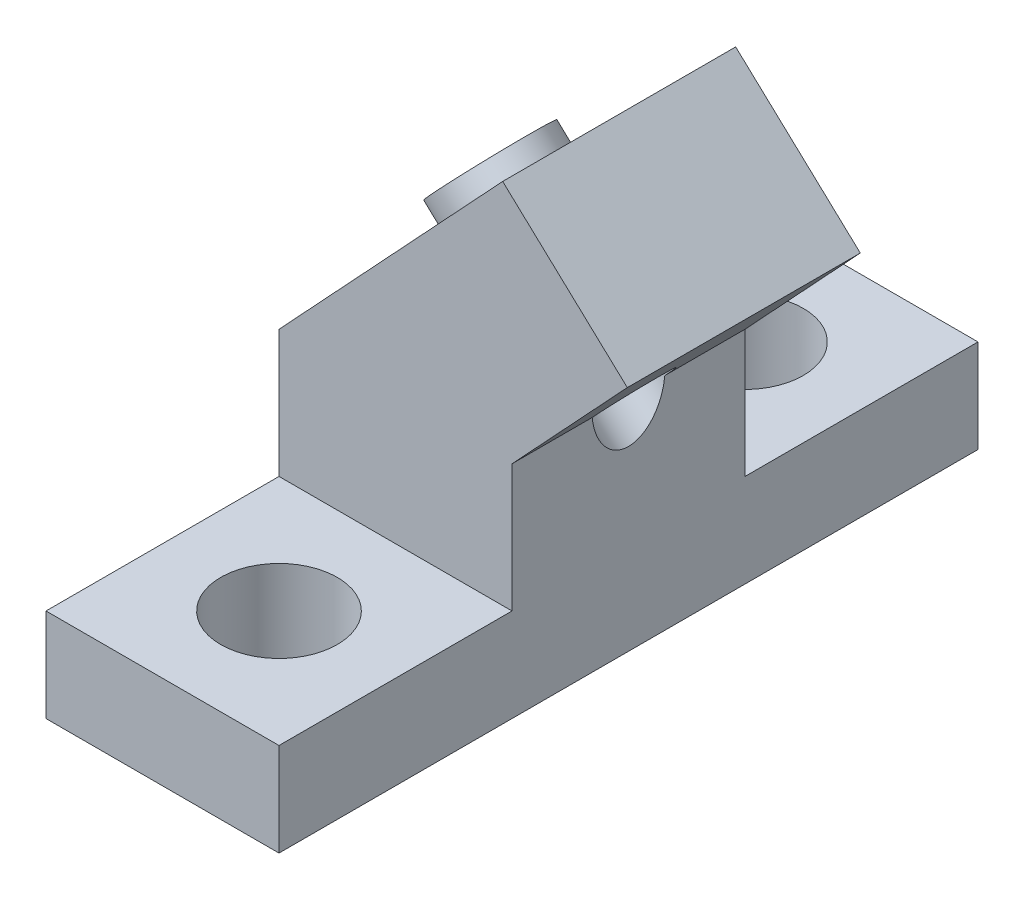
ISO-10303-21;
HEADER;
FILE_DESCRIPTION(('STEP AP214'),'2;1');
FILE_NAME('part.step','',(''),(''),'','','');
FILE_SCHEMA(('AUTOMOTIVE_DESIGN { 1 0 10303 214 1 1 1 1 }'));
ENDSEC;
DATA;
#1=APPLICATION_CONTEXT('core data for automotive mechanical design processes');
#2=APPLICATION_PROTOCOL_DEFINITION('international standard','automotive_design',2000,#1);
#3=PRODUCT_CONTEXT('',#1,'mechanical');
#4=PRODUCT('Part','Part','',(#3));
#5=PRODUCT_RELATED_PRODUCT_CATEGORY('part','',(#4));
#6=PRODUCT_DEFINITION_FORMATION('','',#4);
#7=PRODUCT_DEFINITION_CONTEXT('part definition',#1,'design');
#8=PRODUCT_DEFINITION('design','',#6,#7);
#9=PRODUCT_DEFINITION_SHAPE('','',#8);
#10=(LENGTH_UNIT() NAMED_UNIT(*) SI_UNIT(.MILLI.,.METRE.));
#11=(NAMED_UNIT(*) PLANE_ANGLE_UNIT() SI_UNIT($,.RADIAN.));
#12=(NAMED_UNIT(*) SI_UNIT($,.STERADIAN.) SOLID_ANGLE_UNIT());
#13=UNCERTAINTY_MEASURE_WITH_UNIT(LENGTH_MEASURE(1.E-05),#10,'distance_accuracy_value','');
#14=(GEOMETRIC_REPRESENTATION_CONTEXT(3) GLOBAL_UNCERTAINTY_ASSIGNED_CONTEXT((#13)) GLOBAL_UNIT_ASSIGNED_CONTEXT((#10,
#11,#12)) REPRESENTATION_CONTEXT('',''));
#15=CARTESIAN_POINT('',(0.,0.,0.));
#16=DIRECTION('',(0.,0.,1.));
#17=DIRECTION('',(1.,0.,0.));
#18=AXIS2_PLACEMENT_3D('',#15,#16,#17);
#19=CARTESIAN_POINT('',(0.,12.0277024264101,12.7));
#20=DIRECTION('',(0.731353701619172,-0.681998360062497,0.));
#21=DIRECTION('',(0.681998360062497,0.731353701619172,0.));
#22=AXIS2_PLACEMENT_3D('',#19,#20,#21);
#23=PLANE('',#22);
#24=DIRECTION('',(-0.681998360062497,-0.731353701619172,0.));
#25=VECTOR('',#24,1.);
#26=CARTESIAN_POINT('',(0.,12.0277024264101,0.));
#27=LINE('',#26,#25);
#28=CARTESIAN_POINT('',(12.192,25.1020217390311,0.));
#29=VERTEX_POINT('',#28);
#30=CARTESIAN_POINT('',(0.,12.0277024264101,0.));
#31=VERTEX_POINT('',#30);
#32=EDGE_CURVE('E191',#29,#31,#27,.T.);
#33=ORIENTED_EDGE('',*,*,#32,.T.);
#34=DIRECTION('',(0.,0.,-1.));
#35=VECTOR('',#34,1.);
#36=CARTESIAN_POINT('',(0.,12.0277024264101,12.7));
#37=LINE('',#36,#35);
#38=CARTESIAN_POINT('',(0.,12.0277024264101,12.7));
#39=VERTEX_POINT('',#38);
#40=EDGE_CURVE('E198',#39,#31,#37,.T.);
#41=ORIENTED_EDGE('',*,*,#40,.F.);
#42=DIRECTION('',(-0.681998360062497,-0.731353701619172,0.));
#43=VECTOR('',#42,1.);
#44=CARTESIAN_POINT('',(0.,12.0277024264101,12.7));
#45=LINE('',#44,#43);
#46=CARTESIAN_POINT('',(12.192,25.1020217390311,12.7));
#47=VERTEX_POINT('',#46);
#48=EDGE_CURVE('E196',#47,#39,#45,.T.);
#49=ORIENTED_EDGE('',*,*,#48,.F.);
#50=DIRECTION('',(0.,0.,-1.));
#51=VECTOR('',#50,1.);
#52=CARTESIAN_POINT('',(12.192,25.1020217390311,12.7));
#53=LINE('',#52,#51);
#54=EDGE_CURVE('E207',#47,#29,#53,.T.);
#55=ORIENTED_EDGE('',*,*,#54,.T.);
#56=EDGE_LOOP('',(#33,#41,#49,#55));
#57=FACE_BOUND('',#56,.T.);
#58=CARTESIAN_POINT('',(6.096,18.5648620827206,6.35));
#59=DIRECTION('',(0.731353701619172,-0.681998360062497,0.));
#60=DIRECTION('',(0.681998360062497,0.731353701619172,0.));
#61=AXIS2_PLACEMENT_3D('',#58,#59,#60);
#62=CIRCLE('',#61,3.);
#63=CARTESIAN_POINT('',(8.14199508018749,20.7589231875781,6.35));
#64=VERTEX_POINT('',#63);
#65=EDGE_CURVE('E11',#64,#64,#62,.F.);
#66=ORIENTED_EDGE('',*,*,#65,.F.);
#67=EDGE_LOOP('',(#66));
#68=FACE_BOUND('',#67,.T.);
#69=ADVANCED_FACE('F39',(#57,#68),#23,.F.);
#70=CARTESIAN_POINT('',(0.,0.,0.));
#71=DIRECTION('',(0.,0.,-1.));
#72=DIRECTION('',(-1.,0.,0.));
#73=AXIS2_PLACEMENT_3D('',#70,#71,#72);
#74=PLANE('',#73);
#75=DIRECTION('',(0.,1.,0.));
#76=VECTOR('',#75,1.);
#77=CARTESIAN_POINT('',(12.7,0.,0.));
#78=LINE('',#77,#76);
#79=CARTESIAN_POINT('',(12.7,5.08,0.));
#80=VERTEX_POINT('',#79);
#81=CARTESIAN_POINT('',(12.7,12.0277024264101,0.));
#82=VERTEX_POINT('',#81);
#83=EDGE_CURVE('E200',#80,#82,#78,.T.);
#84=ORIENTED_EDGE('',*,*,#83,.F.);
#85=DIRECTION('',(-1.,0.,0.));
#86=VECTOR('',#85,1.);
#87=CARTESIAN_POINT('',(0.,5.08,0.));
#88=LINE('',#87,#86);
#89=CARTESIAN_POINT('',(0.,5.08,0.));
#90=VERTEX_POINT('',#89);
#91=EDGE_CURVE('E140',#80,#90,#88,.T.);
#92=ORIENTED_EDGE('',*,*,#91,.T.);
#93=DIRECTION('',(0.,-1.,0.));
#94=VECTOR('',#93,1.);
#95=CARTESIAN_POINT('',(0.,0.,0.));
#96=LINE('',#95,#94);
#97=EDGE_CURVE('E128',#31,#90,#96,.T.);
#98=ORIENTED_EDGE('',*,*,#97,.F.);
#99=ORIENTED_EDGE('',*,*,#32,.F.);
#100=DIRECTION('',(0.731353701619172,-0.681998360062497,0.));
#101=VECTOR('',#100,1.);
#102=CARTESIAN_POINT('',(12.192,25.1020217390311,0.));
#103=LINE('',#102,#101);
#104=CARTESIAN_POINT('',(18.9849536082752,18.7674900198812,0.));
#105=VERTEX_POINT('',#104);
#106=EDGE_CURVE('E175',#29,#105,#103,.T.);
#107=ORIENTED_EDGE('',*,*,#106,.T.);
#108=DIRECTION('',(0.681998360062497,0.731353701619172,0.));
#109=VECTOR('',#108,1.);
#110=CARTESIAN_POINT('',(12.7,12.0277024264101,0.));
#111=LINE('',#110,#109);
#112=EDGE_CURVE('E202',#82,#105,#111,.T.);
#113=ORIENTED_EDGE('',*,*,#112,.F.);
#114=EDGE_LOOP('',(#84,#92,#98,#99,#107,#113));
#115=FACE_BOUND('',#114,.T.);
#116=ADVANCED_FACE('F245',(#115),#74,.T.);
#117=CARTESIAN_POINT('',(0.,0.,12.7));
#118=DIRECTION('',(0.,0.,-1.));
#119=DIRECTION('',(-1.,0.,0.));
#120=AXIS2_PLACEMENT_3D('',#117,#118,#119);
#121=PLANE('',#120);
#122=DIRECTION('',(-1.,0.,0.));
#123=VECTOR('',#122,1.);
#124=CARTESIAN_POINT('',(0.,5.08,12.7));
#125=LINE('',#124,#123);
#126=CARTESIAN_POINT('',(12.7,5.08,12.7));
#127=VERTEX_POINT('',#126);
#128=CARTESIAN_POINT('',(0.,5.08,12.7));
#129=VERTEX_POINT('',#128);
#130=EDGE_CURVE('E62',#127,#129,#125,.T.);
#131=ORIENTED_EDGE('',*,*,#130,.F.);
#132=DIRECTION('',(0.,1.,0.));
#133=VECTOR('',#132,1.);
#134=CARTESIAN_POINT('',(12.7,0.,12.7));
#135=LINE('',#134,#133);
#136=CARTESIAN_POINT('',(12.7,12.0277024264101,12.7));
#137=VERTEX_POINT('',#136);
#138=EDGE_CURVE('E190',#127,#137,#135,.T.);
#139=ORIENTED_EDGE('',*,*,#138,.T.);
#140=DIRECTION('',(0.681998360062497,0.731353701619172,0.));
#141=VECTOR('',#140,1.);
#142=CARTESIAN_POINT('',(12.7,12.0277024264101,12.7));
#143=LINE('',#142,#141);
#144=CARTESIAN_POINT('',(18.9849536082752,18.7674900198812,12.7));
#145=VERTEX_POINT('',#144);
#146=EDGE_CURVE('E193',#137,#145,#143,.T.);
#147=ORIENTED_EDGE('',*,*,#146,.T.);
#148=DIRECTION('',(0.731353701619172,-0.681998360062497,0.));
#149=VECTOR('',#148,1.);
#150=CARTESIAN_POINT('',(12.192,25.1020217390311,12.7));
#151=LINE('',#150,#149);
#152=EDGE_CURVE('E174',#47,#145,#151,.T.);
#153=ORIENTED_EDGE('',*,*,#152,.F.);
#154=ORIENTED_EDGE('',*,*,#48,.T.);
#155=DIRECTION('',(0.,-1.,0.));
#156=VECTOR('',#155,1.);
#157=CARTESIAN_POINT('',(0.,0.,12.7));
#158=LINE('',#157,#156);
#159=EDGE_CURVE('E188',#39,#129,#158,.T.);
#160=ORIENTED_EDGE('',*,*,#159,.T.);
#161=EDGE_LOOP('',(#131,#139,#147,#153,#154,#160));
#162=FACE_BOUND('',#161,.T.);
#163=ADVANCED_FACE('F233',(#162),#121,.F.);
#164=CARTESIAN_POINT('',(0.,0.,12.7));
#165=DIRECTION('',(1.,0.,0.));
#166=DIRECTION('',(0.,0.,-1.));
#167=AXIS2_PLACEMENT_3D('',#164,#165,#166);
#168=PLANE('',#167);
#169=ORIENTED_EDGE('',*,*,#97,.T.);
#170=DIRECTION('',(0.,0.,1.));
#171=VECTOR('',#170,1.);
#172=CARTESIAN_POINT('',(0.,5.08,-12.7));
#173=LINE('',#172,#171);
#174=CARTESIAN_POINT('',(0.,5.08,-12.7));
#175=VERTEX_POINT('',#174);
#176=EDGE_CURVE('E54',#175,#90,#173,.T.);
#177=ORIENTED_EDGE('',*,*,#176,.F.);
#178=DIRECTION('',(0.,-1.,0.));
#179=VECTOR('',#178,1.);
#180=CARTESIAN_POINT('',(0.,0.,-12.7));
#181=LINE('',#180,#179);
#182=CARTESIAN_POINT('',(0.,0.,-12.7));
#183=VERTEX_POINT('',#182);
#184=EDGE_CURVE('E124',#175,#183,#181,.T.);
#185=ORIENTED_EDGE('',*,*,#184,.T.);
#186=DIRECTION('',(0.,0.,-1.));
#187=VECTOR('',#186,1.);
#188=CARTESIAN_POINT('',(0.,0.,12.7));
#189=LINE('',#188,#187);
#190=CARTESIAN_POINT('',(0.,0.,25.4));
#191=VERTEX_POINT('',#190);
#192=EDGE_CURVE('E47',#191,#183,#189,.T.);
#193=ORIENTED_EDGE('',*,*,#192,.F.);
#194=DIRECTION('',(0.,-1.,0.));
#195=VECTOR('',#194,1.);
#196=CARTESIAN_POINT('',(0.,0.,25.4));
#197=LINE('',#196,#195);
#198=CARTESIAN_POINT('',(0.,5.08,25.4));
#199=VERTEX_POINT('',#198);
#200=EDGE_CURVE('E157',#199,#191,#197,.T.);
#201=ORIENTED_EDGE('',*,*,#200,.F.);
#202=DIRECTION('',(0.,0.,-1.));
#203=VECTOR('',#202,1.);
#204=CARTESIAN_POINT('',(0.,5.08,25.4));
#205=LINE('',#204,#203);
#206=EDGE_CURVE('E167',#199,#129,#205,.T.);
#207=ORIENTED_EDGE('',*,*,#206,.T.);
#208=ORIENTED_EDGE('',*,*,#159,.F.);
#209=ORIENTED_EDGE('',*,*,#40,.T.);
#210=EDGE_LOOP('',(#169,#177,#185,#193,#201,#207,#208,#209));
#211=FACE_BOUND('',#210,.T.);
#212=ADVANCED_FACE('F41',(#211),#168,.F.);
#213=CARTESIAN_POINT('',(0.,0.,12.7));
#214=DIRECTION('',(0.,1.,0.));
#215=DIRECTION('',(0.,0.,1.));
#216=AXIS2_PLACEMENT_3D('',#213,#214,#215);
#217=PLANE('',#216);
#218=CARTESIAN_POINT('',(6.35,0.,-6.35));
#219=DIRECTION('',(0.,1.,0.));
#220=DIRECTION('',(0.,0.,1.));
#221=AXIS2_PLACEMENT_3D('',#218,#219,#220);
#222=CIRCLE('',#221,3.175);
#223=CARTESIAN_POINT('',(6.35,0.,-3.175));
#224=VERTEX_POINT('',#223);
#225=EDGE_CURVE('E150',#224,#224,#222,.F.);
#226=ORIENTED_EDGE('',*,*,#225,.F.);
#227=EDGE_LOOP('',(#226));
#228=FACE_BOUND('',#227,.T.);
#229=CARTESIAN_POINT('',(6.35,0.,19.05));
#230=DIRECTION('',(0.,1.,0.));
#231=DIRECTION('',(0.,0.,1.));
#232=AXIS2_PLACEMENT_3D('',#229,#230,#231);
#233=CIRCLE('',#232,3.175);
#234=CARTESIAN_POINT('',(6.35,0.,22.225));
#235=VERTEX_POINT('',#234);
#236=EDGE_CURVE('E154',#235,#235,#233,.T.);
#237=ORIENTED_EDGE('',*,*,#236,.T.);
#238=EDGE_LOOP('',(#237));
#239=FACE_BOUND('',#238,.T.);
#240=ORIENTED_EDGE('',*,*,#192,.T.);
#241=DIRECTION('',(1.,0.,0.));
#242=VECTOR('',#241,1.);
#243=CARTESIAN_POINT('',(0.,0.,-12.7));
#244=LINE('',#243,#242);
#245=CARTESIAN_POINT('',(12.7,0.,-12.7));
#246=VERTEX_POINT('',#245);
#247=EDGE_CURVE('E139',#183,#246,#244,.T.);
#248=ORIENTED_EDGE('',*,*,#247,.T.);
#249=DIRECTION('',(0.,0.,-1.));
#250=VECTOR('',#249,1.);
#251=CARTESIAN_POINT('',(12.7,0.,12.7));
#252=LINE('',#251,#250);
#253=CARTESIAN_POINT('',(12.7,0.,25.4));
#254=VERTEX_POINT('',#253);
#255=EDGE_CURVE('E214',#254,#246,#252,.T.);
#256=ORIENTED_EDGE('',*,*,#255,.F.);
#257=DIRECTION('',(1.,0.,0.));
#258=VECTOR('',#257,1.);
#259=CARTESIAN_POINT('',(0.,0.,25.4));
#260=LINE('',#259,#258);
#261=EDGE_CURVE('E160',#191,#254,#260,.T.);
#262=ORIENTED_EDGE('',*,*,#261,.F.);
#263=EDGE_LOOP('',(#240,#248,#256,#262));
#264=FACE_BOUND('',#263,.T.);
#265=ADVANCED_FACE('F217',(#228,#239,#264),#217,.F.);
#266=CARTESIAN_POINT('',(12.7,0.,12.7));
#267=DIRECTION('',(-1.,0.,0.));
#268=DIRECTION('',(0.,-1.,0.));
#269=AXIS2_PLACEMENT_3D('',#266,#267,#268);
#270=PLANE('',#269);
#271=DIRECTION('',(0.,0.,-1.));
#272=VECTOR('',#271,1.);
#273=CARTESIAN_POINT('',(12.7,12.0277024264101,12.7));
#274=LINE('',#273,#272);
#275=CARTESIAN_POINT('',(12.7,12.0277024264101,4.36928334863318));
#276=VERTEX_POINT('',#275);
#277=EDGE_CURVE('E210',#276,#82,#274,.T.);
#278=ORIENTED_EDGE('',*,*,#277,.F.);
#279=CARTESIAN_POINT('',(12.7,12.4065324538675,6.35));
#280=DIRECTION('',(-1.,0.,0.));
#281=DIRECTION('',(0.,1.,0.));
#282=AXIS2_PLACEMENT_3D('',#279,#280,#281);
#283=ELLIPSE('',#282,2.73465492219718,2.);
#284=CARTESIAN_POINT('',(12.7,12.0277024264101,8.33071665136682));
#285=VERTEX_POINT('',#284);
#286=EDGE_CURVE('E185',#276,#285,#283,.T.);
#287=ORIENTED_EDGE('',*,*,#286,.T.);
#288=EDGE_CURVE('E211',#137,#285,#274,.T.);
#289=ORIENTED_EDGE('',*,*,#288,.F.);
#290=ORIENTED_EDGE('',*,*,#138,.F.);
#291=DIRECTION('',(0.,0.,-1.));
#292=VECTOR('',#291,1.);
#293=CARTESIAN_POINT('',(12.7,5.08,25.4));
#294=LINE('',#293,#292);
#295=CARTESIAN_POINT('',(12.7,5.08,25.4));
#296=VERTEX_POINT('',#295);
#297=EDGE_CURVE('E171',#296,#127,#294,.T.);
#298=ORIENTED_EDGE('',*,*,#297,.F.);
#299=DIRECTION('',(0.,1.,0.));
#300=VECTOR('',#299,1.);
#301=CARTESIAN_POINT('',(12.7,0.,25.4));
#302=LINE('',#301,#300);
#303=EDGE_CURVE('E163',#254,#296,#302,.T.);
#304=ORIENTED_EDGE('',*,*,#303,.F.);
#305=ORIENTED_EDGE('',*,*,#255,.T.);
#306=DIRECTION('',(0.,1.,0.));
#307=VECTOR('',#306,1.);
#308=CARTESIAN_POINT('',(12.7,0.,-12.7));
#309=LINE('',#308,#307);
#310=CARTESIAN_POINT('',(12.7,5.08,-12.7));
#311=VERTEX_POINT('',#310);
#312=EDGE_CURVE('E143',#246,#311,#309,.T.);
#313=ORIENTED_EDGE('',*,*,#312,.T.);
#314=DIRECTION('',(0.,0.,1.));
#315=VECTOR('',#314,1.);
#316=CARTESIAN_POINT('',(12.7,5.08,-12.7));
#317=LINE('',#316,#315);
#318=EDGE_CURVE('E130',#311,#80,#317,.T.);
#319=ORIENTED_EDGE('',*,*,#318,.T.);
#320=ORIENTED_EDGE('',*,*,#83,.T.);
#321=EDGE_LOOP('',(#278,#287,#289,#290,#298,#304,#305,#313,#319,#320));
#322=FACE_BOUND('',#321,.T.);
#323=ADVANCED_FACE('F230',(#322),#270,.F.);
#324=CARTESIAN_POINT('',(12.7,12.0277024264101,12.7));
#325=DIRECTION('',(-0.731353701619172,0.681998360062497,0.));
#326=DIRECTION('',(-0.681998360062497,-0.731353701619172,0.));
#327=AXIS2_PLACEMENT_3D('',#324,#325,#326);
#328=PLANE('',#327);
#329=ORIENTED_EDGE('',*,*,#112,.T.);
#330=DIRECTION('',(0.,0.,1.));
#331=VECTOR('',#330,1.);
#332=CARTESIAN_POINT('',(18.9849536082752,18.7674900198812,0.));
#333=LINE('',#332,#331);
#334=EDGE_CURVE('E178',#105,#145,#333,.T.);
#335=ORIENTED_EDGE('',*,*,#334,.T.);
#336=ORIENTED_EDGE('',*,*,#146,.F.);
#337=ORIENTED_EDGE('',*,*,#288,.T.);
#338=CARTESIAN_POINT('',(12.8889536082752,12.2303303635707,6.35));
#339=DIRECTION('',(-0.731353701619172,0.681998360062497,0.));
#340=DIRECTION('',(-0.681998360062497,-0.731353701619172,0.));
#341=AXIS2_PLACEMENT_3D('',#338,#339,#340);
#342=CIRCLE('',#341,2.);
#343=EDGE_CURVE('E182',#285,#276,#342,.T.);
#344=ORIENTED_EDGE('',*,*,#343,.T.);
#345=ORIENTED_EDGE('',*,*,#277,.T.);
#346=EDGE_LOOP('',(#329,#335,#336,#337,#344,#345));
#347=FACE_BOUND('',#346,.T.);
#348=ADVANCED_FACE('F237',(#347),#328,.F.);
#349=CARTESIAN_POINT('',(15.3841920105635,9.90348290992692,6.35));
#350=DIRECTION('',(-0.731353701619172,0.681998360062497,0.));
#351=DIRECTION('',(-0.681998360062497,-0.731353701619172,0.));
#352=AXIS2_PLACEMENT_3D('',#349,#350,#351);
#353=CYLINDRICAL_SURFACE('',#352,2.);
#354=ORIENTED_EDGE('',*,*,#343,.F.);
#355=ORIENTED_EDGE('',*,*,#286,.F.);
#356=EDGE_LOOP('',(#354,#355));
#357=FACE_BOUND('',#356,.T.);
#358=CARTESIAN_POINT('',(5.16718079894365,19.431,6.35));
#359=DIRECTION('',(-0.731353701619172,0.681998360062497,0.));
#360=DIRECTION('',(-0.681998360062497,-0.731353701619172,0.));
#361=AXIS2_PLACEMENT_3D('',#358,#359,#360);
#362=CIRCLE('',#361,2.);
#363=CARTESIAN_POINT('',(3.80318407881866,17.9682925967617,6.35));
#364=VERTEX_POINT('',#363);
#365=EDGE_CURVE('E314',#364,#364,#362,.T.);
#366=ORIENTED_EDGE('',*,*,#365,.T.);
#367=EDGE_LOOP('',(#366));
#368=FACE_BOUND('',#367,.T.);
#369=ADVANCED_FACE('F285',(#357,#368),#353,.F.);
#370=CARTESIAN_POINT('',(12.192,25.1020217390311,0.));
#371=DIRECTION('',(-0.681998360062497,-0.731353701619172,0.));
#372=DIRECTION('',(0.731353701619172,-0.681998360062497,0.));
#373=AXIS2_PLACEMENT_3D('',#370,#371,#372);
#374=PLANE('',#373);
#375=ORIENTED_EDGE('',*,*,#152,.T.);
#376=ORIENTED_EDGE('',*,*,#334,.F.);
#377=ORIENTED_EDGE('',*,*,#106,.F.);
#378=ORIENTED_EDGE('',*,*,#54,.F.);
#379=EDGE_LOOP('',(#375,#376,#377,#378));
#380=FACE_BOUND('',#379,.T.);
#381=ADVANCED_FACE('F241',(#380),#374,.F.);
#382=CARTESIAN_POINT('',(0.,5.08,25.4));
#383=DIRECTION('',(0.,-1.,0.));
#384=DIRECTION('',(0.,0.,-1.));
#385=AXIS2_PLACEMENT_3D('',#382,#383,#384);
#386=PLANE('',#385);
#387=CARTESIAN_POINT('',(6.35,5.08,19.05));
#388=DIRECTION('',(0.,1.,0.));
#389=DIRECTION('',(0.,0.,1.));
#390=AXIS2_PLACEMENT_3D('',#387,#388,#389);
#391=CIRCLE('',#390,3.175);
#392=CARTESIAN_POINT('',(6.35,5.08,22.225));
#393=VERTEX_POINT('',#392);
#394=EDGE_CURVE('E129',#393,#393,#391,.T.);
#395=ORIENTED_EDGE('',*,*,#394,.F.);
#396=EDGE_LOOP('',(#395));
#397=FACE_BOUND('',#396,.T.);
#398=ORIENTED_EDGE('',*,*,#130,.T.);
#399=ORIENTED_EDGE('',*,*,#206,.F.);
#400=DIRECTION('',(-1.,0.,0.));
#401=VECTOR('',#400,1.);
#402=CARTESIAN_POINT('',(0.,5.08,25.4));
#403=LINE('',#402,#401);
#404=EDGE_CURVE('E165',#296,#199,#403,.T.);
#405=ORIENTED_EDGE('',*,*,#404,.F.);
#406=ORIENTED_EDGE('',*,*,#297,.T.);
#407=EDGE_LOOP('',(#398,#399,#405,#406));
#408=FACE_BOUND('',#407,.T.);
#409=ADVANCED_FACE('F227',(#397,#408),#386,.F.);
#410=CARTESIAN_POINT('',(0.,0.,25.4));
#411=DIRECTION('',(0.,0.,-1.));
#412=DIRECTION('',(-1.,0.,0.));
#413=AXIS2_PLACEMENT_3D('',#410,#411,#412);
#414=PLANE('',#413);
#415=ORIENTED_EDGE('',*,*,#200,.T.);
#416=ORIENTED_EDGE('',*,*,#261,.T.);
#417=ORIENTED_EDGE('',*,*,#303,.T.);
#418=ORIENTED_EDGE('',*,*,#404,.T.);
#419=EDGE_LOOP('',(#415,#416,#417,#418));
#420=FACE_BOUND('',#419,.T.);
#421=ADVANCED_FACE('F222',(#420),#414,.F.);
#422=CARTESIAN_POINT('',(6.35,-7.62,19.05));
#423=DIRECTION('',(0.,1.,0.));
#424=DIRECTION('',(0.,0.,1.));
#425=AXIS2_PLACEMENT_3D('',#422,#423,#424);
#426=CYLINDRICAL_SURFACE('',#425,3.175);
#427=ORIENTED_EDGE('',*,*,#394,.T.);
#428=EDGE_LOOP('',(#427));
#429=FACE_BOUND('',#428,.T.);
#430=ORIENTED_EDGE('',*,*,#236,.F.);
#431=EDGE_LOOP('',(#430));
#432=FACE_BOUND('',#431,.T.);
#433=ADVANCED_FACE('F273',(#429,#432),#426,.F.);
#434=CARTESIAN_POINT('',(0.,5.08,-12.7));
#435=DIRECTION('',(0.,1.,0.));
#436=DIRECTION('',(0.,0.,1.));
#437=AXIS2_PLACEMENT_3D('',#434,#435,#436);
#438=PLANE('',#437);
#439=CARTESIAN_POINT('',(6.35,5.08,-6.35));
#440=DIRECTION('',(0.,-1.,0.));
#441=DIRECTION('',(0.,0.,-1.));
#442=AXIS2_PLACEMENT_3D('',#439,#440,#441);
#443=CIRCLE('',#442,3.175);
#444=CARTESIAN_POINT('',(6.35,5.08,-9.525));
#445=VERTEX_POINT('',#444);
#446=EDGE_CURVE('E307',#445,#445,#443,.T.);
#447=ORIENTED_EDGE('',*,*,#446,.T.);
#448=EDGE_LOOP('',(#447));
#449=FACE_BOUND('',#448,.T.);
#450=ORIENTED_EDGE('',*,*,#91,.F.);
#451=ORIENTED_EDGE('',*,*,#318,.F.);
#452=DIRECTION('',(-1.,0.,0.));
#453=VECTOR('',#452,1.);
#454=CARTESIAN_POINT('',(0.,5.08,-12.7));
#455=LINE('',#454,#453);
#456=EDGE_CURVE('E136',#311,#175,#455,.T.);
#457=ORIENTED_EDGE('',*,*,#456,.T.);
#458=ORIENTED_EDGE('',*,*,#176,.T.);
#459=EDGE_LOOP('',(#450,#451,#457,#458));
#460=FACE_BOUND('',#459,.T.);
#461=ADVANCED_FACE('F142',(#449,#460),#438,.T.);
#462=CARTESIAN_POINT('',(0.,0.,-12.7));
#463=DIRECTION('',(0.,0.,1.));
#464=DIRECTION('',(-1.,0.,0.));
#465=AXIS2_PLACEMENT_3D('',#462,#463,#464);
#466=PLANE('',#465);
#467=ORIENTED_EDGE('',*,*,#184,.F.);
#468=ORIENTED_EDGE('',*,*,#456,.F.);
#469=ORIENTED_EDGE('',*,*,#312,.F.);
#470=ORIENTED_EDGE('',*,*,#247,.F.);
#471=EDGE_LOOP('',(#467,#468,#469,#470));
#472=FACE_BOUND('',#471,.T.);
#473=ADVANCED_FACE('F134',(#472),#466,.F.);
#474=CARTESIAN_POINT('',(6.35,-7.62,-6.35));
#475=DIRECTION('',(0.,1.,0.));
#476=DIRECTION('',(0.,0.,1.));
#477=AXIS2_PLACEMENT_3D('',#474,#475,#476);
#478=CYLINDRICAL_SURFACE('',#477,3.175);
#479=ORIENTED_EDGE('',*,*,#446,.F.);
#480=EDGE_LOOP('',(#479));
#481=FACE_BOUND('',#480,.T.);
#482=ORIENTED_EDGE('',*,*,#225,.T.);
#483=EDGE_LOOP('',(#482));
#484=FACE_BOUND('',#483,.T.);
#485=ADVANCED_FACE('F261',(#481,#484),#478,.F.);
#486=CARTESIAN_POINT('',(5.16718079894365,19.431,6.35));
#487=DIRECTION('',(-0.731353701619172,0.681998360062497,0.));
#488=DIRECTION('',(-0.681998360062497,-0.731353701619172,0.));
#489=AXIS2_PLACEMENT_3D('',#486,#487,#488);
#490=PLANE('',#489);
#491=CARTESIAN_POINT('',(5.16718079894365,19.431,6.35));
#492=DIRECTION('',(-0.731353701619172,0.681998360062497,0.));
#493=DIRECTION('',(-0.681998360062497,-0.731353701619172,0.));
#494=AXIS2_PLACEMENT_3D('',#491,#492,#493);
#495=CIRCLE('',#494,3.);
#496=CARTESIAN_POINT('',(3.12118571875616,17.2369388951425,6.35));
#497=VERTEX_POINT('',#496);
#498=EDGE_CURVE('E309',#497,#497,#495,.T.);
#499=ORIENTED_EDGE('',*,*,#498,.T.);
#500=EDGE_LOOP('',(#499));
#501=FACE_BOUND('',#500,.T.);
#502=ORIENTED_EDGE('',*,*,#365,.F.);
#503=EDGE_LOOP('',(#502));
#504=FACE_BOUND('',#503,.T.);
#505=ADVANCED_FACE('F255',(#501,#504),#490,.T.);
#506=CARTESIAN_POINT('',(5.16718079894365,19.431,6.35));
#507=DIRECTION('',(0.731353701619172,-0.681998360062497,0.));
#508=DIRECTION('',(0.681998360062497,0.731353701619172,0.));
#509=AXIS2_PLACEMENT_3D('',#506,#507,#508);
#510=CYLINDRICAL_SURFACE('',#509,3.);
#511=ORIENTED_EDGE('',*,*,#498,.F.);
#512=EDGE_LOOP('',(#511));
#513=FACE_BOUND('',#512,.T.);
#514=ORIENTED_EDGE('',*,*,#65,.T.);
#515=EDGE_LOOP('',(#514));
#516=FACE_BOUND('',#515,.T.);
#517=ADVANCED_FACE('F253',(#513,#516),#510,.T.);
#518=CLOSED_SHELL('',(#69,#116,#163,#212,#265,#323,#348,#369,#381,#409,#421,#433,#461,#473,#485,
#505,#517));
#519=MANIFOLD_SOLID_BREP('B2',#518);
#520=ADVANCED_BREP_SHAPE_REPRESENTATION('',(#18,#519),#14);
#521=SHAPE_DEFINITION_REPRESENTATION(#9,#520);
ENDSEC;
END-ISO-10303-21;
